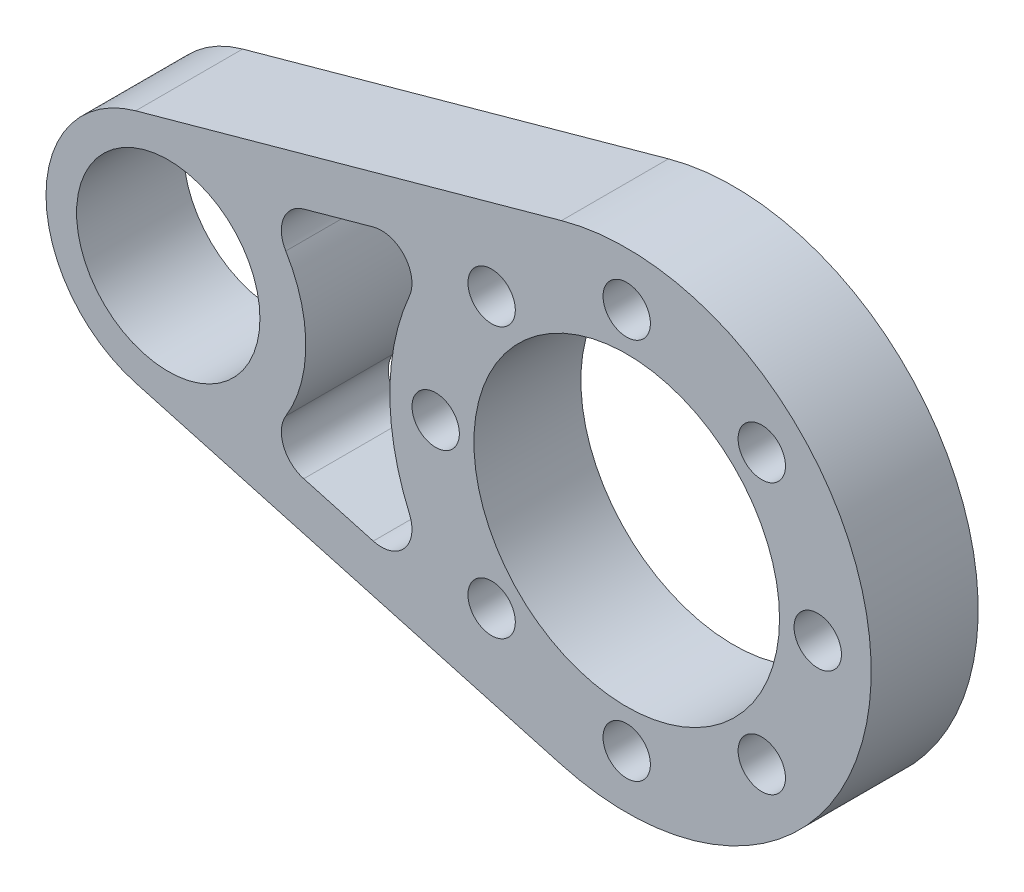
ISO-10303-21;
HEADER;
FILE_DESCRIPTION(('STEP AP214'),'2;1');
FILE_NAME('part.step','',(''),(''),'','','');
FILE_SCHEMA(('AUTOMOTIVE_DESIGN { 1 0 10303 214 1 1 1 1 }'));
ENDSEC;
DATA;
#1=APPLICATION_CONTEXT('core data for automotive mechanical design processes');
#2=APPLICATION_PROTOCOL_DEFINITION('international standard','automotive_design',2000,#1);
#3=PRODUCT_CONTEXT('',#1,'mechanical');
#4=PRODUCT('Part','Part','',(#3));
#5=PRODUCT_RELATED_PRODUCT_CATEGORY('part','',(#4));
#6=PRODUCT_DEFINITION_FORMATION('','',#4);
#7=PRODUCT_DEFINITION_CONTEXT('part definition',#1,'design');
#8=PRODUCT_DEFINITION('design','',#6,#7);
#9=PRODUCT_DEFINITION_SHAPE('','',#8);
#10=(LENGTH_UNIT() NAMED_UNIT(*) SI_UNIT(.MILLI.,.METRE.));
#11=(NAMED_UNIT(*) PLANE_ANGLE_UNIT() SI_UNIT($,.RADIAN.));
#12=(NAMED_UNIT(*) SI_UNIT($,.STERADIAN.) SOLID_ANGLE_UNIT());
#13=UNCERTAINTY_MEASURE_WITH_UNIT(LENGTH_MEASURE(1.E-05),#10,'distance_accuracy_value','');
#14=(GEOMETRIC_REPRESENTATION_CONTEXT(3) GLOBAL_UNCERTAINTY_ASSIGNED_CONTEXT((#13)) GLOBAL_UNIT_ASSIGNED_CONTEXT((#10,
#11,#12)) REPRESENTATION_CONTEXT('',''));
#15=CARTESIAN_POINT('',(0.,0.,0.));
#16=DIRECTION('',(0.,0.,1.));
#17=DIRECTION('',(1.,0.,0.));
#18=AXIS2_PLACEMENT_3D('',#15,#16,#17);
#19=CARTESIAN_POINT('',(30.,0.,7.));
#20=DIRECTION('',(0.,0.,1.));
#21=DIRECTION('',(1.,0.,0.));
#22=AXIS2_PLACEMENT_3D('',#19,#20,#21);
#23=PLANE('',#22);
#24=CARTESIAN_POINT('',(42.5,-1.42247325030098E-13,7.));
#25=DIRECTION('',(0.,0.,1.));
#26=DIRECTION('',(1.,0.,0.));
#27=AXIS2_PLACEMENT_3D('',#24,#25,#26);
#28=CIRCLE('',#27,1.55);
#29=CARTESIAN_POINT('',(44.05,-1.42247325030098E-13,7.));
#30=VERTEX_POINT('',#29);
#31=EDGE_CURVE('E225',#30,#30,#28,.T.);
#32=ORIENTED_EDGE('',*,*,#31,.F.);
#33=EDGE_LOOP('',(#32));
#34=FACE_BOUND('',#33,.T.);
#35=CARTESIAN_POINT('',(30.0000000000003,12.5,7.));
#36=DIRECTION('',(0.,0.,1.));
#37=DIRECTION('',(1.,0.,0.));
#38=AXIS2_PLACEMENT_3D('',#35,#36,#37);
#39=CIRCLE('',#38,1.55);
#40=CARTESIAN_POINT('',(31.5500000000003,12.5,7.));
#41=VERTEX_POINT('',#40);
#42=EDGE_CURVE('E237',#41,#41,#39,.T.);
#43=ORIENTED_EDGE('',*,*,#42,.F.);
#44=EDGE_LOOP('',(#43));
#45=FACE_BOUND('',#44,.T.);
#46=CARTESIAN_POINT('',(17.5,2.25514051876985E-13,7.));
#47=DIRECTION('',(0.,0.,1.));
#48=DIRECTION('',(1.,0.,0.));
#49=AXIS2_PLACEMENT_3D('',#46,#47,#48);
#50=CIRCLE('',#49,1.55);
#51=CARTESIAN_POINT('',(19.05,2.25514051876985E-13,7.));
#52=VERTEX_POINT('',#51);
#53=EDGE_CURVE('E249',#52,#52,#50,.T.);
#54=ORIENTED_EDGE('',*,*,#53,.F.);
#55=EDGE_LOOP('',(#54));
#56=FACE_BOUND('',#55,.T.);
#57=CARTESIAN_POINT('',(30.,-12.5,7.));
#58=DIRECTION('',(0.,0.,1.));
#59=DIRECTION('',(1.,0.,0.));
#60=AXIS2_PLACEMENT_3D('',#57,#58,#59);
#61=CIRCLE('',#60,1.55);
#62=CARTESIAN_POINT('',(31.55,-12.5,7.));
#63=VERTEX_POINT('',#62);
#64=EDGE_CURVE('E261',#63,#63,#61,.T.);
#65=ORIENTED_EDGE('',*,*,#64,.F.);
#66=EDGE_LOOP('',(#65));
#67=FACE_BOUND('',#66,.T.);
#68=CARTESIAN_POINT('',(0.,0.,7.));
#69=DIRECTION('',(0.,0.,1.));
#70=DIRECTION('',(1.,0.,0.));
#71=AXIS2_PLACEMENT_3D('',#68,#69,#70);
#72=CIRCLE('',#71,6.);
#73=CARTESIAN_POINT('',(6.,0.,7.));
#74=VERTEX_POINT('',#73);
#75=EDGE_CURVE('E273',#74,#74,#72,.T.);
#76=ORIENTED_EDGE('',*,*,#75,.F.);
#77=EDGE_LOOP('',(#76));
#78=FACE_BOUND('',#77,.T.);
#79=CARTESIAN_POINT('',(30.,0.,7.));
#80=DIRECTION('',(0.,0.,1.));
#81=DIRECTION('',(1.,0.,0.));
#82=AXIS2_PLACEMENT_3D('',#79,#80,#81);
#83=CIRCLE('',#82,16.);
#84=CARTESIAN_POINT('',(25.7333333333333,-15.4206211144544,7.));
#85=VERTEX_POINT('',#84);
#86=CARTESIAN_POINT('',(25.7333333333333,15.4206211144544,7.));
#87=VERTEX_POINT('',#86);
#88=EDGE_CURVE('E134',#85,#87,#83,.T.);
#89=ORIENTED_EDGE('',*,*,#88,.T.);
#90=DIRECTION('',(-0.963788819653397,-0.266666666666667,0.));
#91=VECTOR('',#90,1.);
#92=CARTESIAN_POINT('',(25.7333333333333,15.4206211144544,7.));
#93=LINE('',#92,#91);
#94=CARTESIAN_POINT('',(-2.13333333333333,7.71031055722718,7.));
#95=VERTEX_POINT('',#94);
#96=EDGE_CURVE('E123',#87,#95,#93,.T.);
#97=ORIENTED_EDGE('',*,*,#96,.T.);
#98=CARTESIAN_POINT('',(0.,0.,7.));
#99=DIRECTION('',(0.,0.,1.));
#100=DIRECTION('',(1.,0.,0.));
#101=AXIS2_PLACEMENT_3D('',#98,#99,#100);
#102=CIRCLE('',#101,8.);
#103=CARTESIAN_POINT('',(-2.13333333333333,-7.71031055722718,7.));
#104=VERTEX_POINT('',#103);
#105=EDGE_CURVE('E133',#95,#104,#102,.T.);
#106=ORIENTED_EDGE('',*,*,#105,.T.);
#107=DIRECTION('',(0.963788819653397,-0.266666666666667,0.));
#108=VECTOR('',#107,1.);
#109=CARTESIAN_POINT('',(25.7333333333333,-15.4206211144544,7.));
#110=LINE('',#109,#108);
#111=EDGE_CURVE('E139',#104,#85,#110,.T.);
#112=ORIENTED_EDGE('',*,*,#111,.T.);
#113=EDGE_LOOP('',(#89,#97,#106,#112));
#114=FACE_BOUND('',#113,.T.);
#115=CARTESIAN_POINT('',(30.,0.,7.));
#116=DIRECTION('',(0.,0.,1.));
#117=DIRECTION('',(1.,0.,0.));
#118=AXIS2_PLACEMENT_3D('',#115,#116,#117);
#119=CIRCLE('',#118,10.);
#120=CARTESIAN_POINT('',(40.,0.,7.));
#121=VERTEX_POINT('',#120);
#122=EDGE_CURVE('E267',#121,#121,#119,.T.);
#123=ORIENTED_EDGE('',*,*,#122,.F.);
#124=EDGE_LOOP('',(#123));
#125=FACE_BOUND('',#124,.T.);
#126=CARTESIAN_POINT('',(21.161165235168,-8.8388347648317,7.));
#127=DIRECTION('',(0.,0.,1.));
#128=DIRECTION('',(1.,0.,0.));
#129=AXIS2_PLACEMENT_3D('',#126,#127,#128);
#130=CIRCLE('',#129,1.55);
#131=CARTESIAN_POINT('',(22.711165235168,-8.8388347648317,7.));
#132=VERTEX_POINT('',#131);
#133=EDGE_CURVE('E255',#132,#132,#130,.T.);
#134=ORIENTED_EDGE('',*,*,#133,.F.);
#135=EDGE_LOOP('',(#134));
#136=FACE_BOUND('',#135,.T.);
#137=CARTESIAN_POINT('',(21.1611652351683,8.83883476483202,7.));
#138=DIRECTION('',(0.,0.,1.));
#139=DIRECTION('',(1.,0.,0.));
#140=AXIS2_PLACEMENT_3D('',#137,#138,#139);
#141=CIRCLE('',#140,1.55);
#142=CARTESIAN_POINT('',(22.7111652351683,8.83883476483202,7.));
#143=VERTEX_POINT('',#142);
#144=EDGE_CURVE('E243',#143,#143,#141,.T.);
#145=ORIENTED_EDGE('',*,*,#144,.F.);
#146=EDGE_LOOP('',(#145));
#147=FACE_BOUND('',#146,.T.);
#148=CARTESIAN_POINT('',(38.8388347648321,8.83883476483164,7.));
#149=DIRECTION('',(0.,0.,1.));
#150=DIRECTION('',(1.,0.,0.));
#151=AXIS2_PLACEMENT_3D('',#148,#149,#150);
#152=CIRCLE('',#151,1.55);
#153=CARTESIAN_POINT('',(40.388834764832,8.83883476483164,7.));
#154=VERTEX_POINT('',#153);
#155=EDGE_CURVE('E231',#154,#154,#152,.T.);
#156=ORIENTED_EDGE('',*,*,#155,.F.);
#157=EDGE_LOOP('',(#156));
#158=FACE_BOUND('',#157,.T.);
#159=CARTESIAN_POINT('',(38.8388347648317,-8.83883476483195,7.));
#160=DIRECTION('',(0.,0.,1.));
#161=DIRECTION('',(1.,0.,0.));
#162=AXIS2_PLACEMENT_3D('',#159,#160,#161);
#163=CIRCLE('',#162,1.55);
#164=CARTESIAN_POINT('',(40.3888347648317,-8.83883476483195,7.));
#165=VERTEX_POINT('',#164);
#166=EDGE_CURVE('E219',#165,#165,#163,.T.);
#167=ORIENTED_EDGE('',*,*,#166,.F.);
#168=EDGE_LOOP('',(#167));
#169=FACE_BOUND('',#168,.T.);
#170=DIRECTION('',(0.963788819653397,-0.266666666666667,0.));
#171=VECTOR('',#170,1.);
#172=CARTESIAN_POINT('',(5.87900177935921,-6.81449470454642,7.));
#173=LINE('',#172,#171);
#174=CARTESIAN_POINT('',(8.86644879941615,-7.64107883006922,7.));
#175=VERTEX_POINT('',#174);
#176=CARTESIAN_POINT('',(13.4155337211016,-8.89974596514318,7.));
#177=VERTEX_POINT('',#176);
#178=EDGE_CURVE('E201',#175,#177,#173,.T.);
#179=ORIENTED_EDGE('',*,*,#178,.F.);
#180=CARTESIAN_POINT('',(9.39978213274948,-5.71350119076242,7.));
#181=DIRECTION('',(0.,0.,1.));
#182=DIRECTION('',(1.,0.,0.));
#183=AXIS2_PLACEMENT_3D('',#180,#181,#182);
#184=CIRCLE('',#183,2.);
#185=CARTESIAN_POINT('',(7.69073083588594,-4.67468279244198,7.));
#186=VERTEX_POINT('',#185);
#187=EDGE_CURVE('E182',#175,#186,#184,.F.);
#188=ORIENTED_EDGE('',*,*,#187,.T.);
#189=CARTESIAN_POINT('',(0.,0.,7.));
#190=DIRECTION('',(0.,0.,-1.));
#191=DIRECTION('',(1.,0.,0.));
#192=AXIS2_PLACEMENT_3D('',#189,#190,#191);
#193=CIRCLE('',#192,9.);
#194=CARTESIAN_POINT('',(7.69073083588594,4.67468279244198,7.));
#195=VERTEX_POINT('',#194);
#196=EDGE_CURVE('E204',#195,#186,#193,.T.);
#197=ORIENTED_EDGE('',*,*,#196,.F.);
#198=CARTESIAN_POINT('',(9.39978213274948,5.71350119076242,7.));
#199=DIRECTION('',(0.,0.,1.));
#200=DIRECTION('',(1.,0.,0.));
#201=AXIS2_PLACEMENT_3D('',#198,#199,#200);
#202=CIRCLE('',#201,2.);
#203=CARTESIAN_POINT('',(8.86644879941615,7.64107883006922,7.));
#204=VERTEX_POINT('',#203);
#205=EDGE_CURVE('E178',#195,#204,#202,.F.);
#206=ORIENTED_EDGE('',*,*,#205,.T.);
#207=DIRECTION('',(-0.963788819653397,-0.266666666666667,0.));
#208=VECTOR('',#207,1.);
#209=CARTESIAN_POINT('',(18.3980193668454,10.2783289200096,7.));
#210=LINE('',#209,#208);
#211=CARTESIAN_POINT('',(13.4155337211016,8.89974596514318,7.));
#212=VERTEX_POINT('',#211);
#213=EDGE_CURVE('E206',#212,#204,#210,.T.);
#214=ORIENTED_EDGE('',*,*,#213,.F.);
#215=CARTESIAN_POINT('',(13.948867054435,6.97216832583638,7.));
#216=DIRECTION('',(0.,0.,1.));
#217=DIRECTION('',(1.,0.,0.));
#218=AXIS2_PLACEMENT_3D('',#215,#216,#217);
#219=CIRCLE('',#218,2.);
#220=CARTESIAN_POINT('',(15.7832822482138,6.17534908859794,7.));
#221=VERTEX_POINT('',#220);
#222=EDGE_CURVE('E174',#212,#221,#219,.F.);
#223=ORIENTED_EDGE('',*,*,#222,.T.);
#224=CARTESIAN_POINT('',(30.,0.,7.));
#225=DIRECTION('',(0.,0.,-1.));
#226=DIRECTION('',(-1.,0.,0.));
#227=AXIS2_PLACEMENT_3D('',#224,#225,#226);
#228=CIRCLE('',#227,15.5);
#229=CARTESIAN_POINT('',(15.7832822482138,-6.17534908859794,7.));
#230=VERTEX_POINT('',#229);
#231=EDGE_CURVE('E203',#230,#221,#228,.T.);
#232=ORIENTED_EDGE('',*,*,#231,.F.);
#233=CARTESIAN_POINT('',(13.948867054435,-6.97216832583639,7.));
#234=DIRECTION('',(0.,0.,1.));
#235=DIRECTION('',(1.,0.,0.));
#236=AXIS2_PLACEMENT_3D('',#233,#234,#235);
#237=CIRCLE('',#236,2.);
#238=EDGE_CURVE('E11',#230,#177,#237,.F.);
#239=ORIENTED_EDGE('',*,*,#238,.T.);
#240=EDGE_LOOP('',(#179,#188,#197,#206,#214,#223,#232,#239));
#241=FACE_BOUND('',#240,.T.);
#242=ADVANCED_FACE('F34',(#34,#45,#56,#67,#78,#114,#125,#136,#147,#158,#169,#241),#23,.T.);
#243=CARTESIAN_POINT('',(30.,0.,0.));
#244=DIRECTION('',(0.,0.,1.));
#245=DIRECTION('',(1.,0.,0.));
#246=AXIS2_PLACEMENT_3D('',#243,#244,#245);
#247=PLANE('',#246);
#248=CARTESIAN_POINT('',(38.8388347648317,-8.83883476483195,0.));
#249=DIRECTION('',(0.,0.,1.));
#250=DIRECTION('',(1.,0.,0.));
#251=AXIS2_PLACEMENT_3D('',#248,#249,#250);
#252=CIRCLE('',#251,1.55);
#253=CARTESIAN_POINT('',(40.3888347648317,-8.83883476483195,0.));
#254=VERTEX_POINT('',#253);
#255=EDGE_CURVE('E213',#254,#254,#252,.T.);
#256=ORIENTED_EDGE('',*,*,#255,.T.);
#257=EDGE_LOOP('',(#256));
#258=FACE_BOUND('',#257,.T.);
#259=CARTESIAN_POINT('',(42.5,-1.42247325030098E-13,0.));
#260=DIRECTION('',(0.,0.,1.));
#261=DIRECTION('',(1.,0.,0.));
#262=AXIS2_PLACEMENT_3D('',#259,#260,#261);
#263=CIRCLE('',#262,1.55);
#264=CARTESIAN_POINT('',(44.05,-1.42247325030098E-13,0.));
#265=VERTEX_POINT('',#264);
#266=EDGE_CURVE('E222',#265,#265,#263,.T.);
#267=ORIENTED_EDGE('',*,*,#266,.T.);
#268=EDGE_LOOP('',(#267));
#269=FACE_BOUND('',#268,.T.);
#270=CARTESIAN_POINT('',(38.8388347648321,8.83883476483164,0.));
#271=DIRECTION('',(0.,0.,1.));
#272=DIRECTION('',(1.,0.,0.));
#273=AXIS2_PLACEMENT_3D('',#270,#271,#272);
#274=CIRCLE('',#273,1.55);
#275=CARTESIAN_POINT('',(40.388834764832,8.83883476483164,0.));
#276=VERTEX_POINT('',#275);
#277=EDGE_CURVE('E228',#276,#276,#274,.T.);
#278=ORIENTED_EDGE('',*,*,#277,.T.);
#279=EDGE_LOOP('',(#278));
#280=FACE_BOUND('',#279,.T.);
#281=CARTESIAN_POINT('',(30.0000000000003,12.5,0.));
#282=DIRECTION('',(0.,0.,1.));
#283=DIRECTION('',(1.,0.,0.));
#284=AXIS2_PLACEMENT_3D('',#281,#282,#283);
#285=CIRCLE('',#284,1.55);
#286=CARTESIAN_POINT('',(31.5500000000003,12.5,0.));
#287=VERTEX_POINT('',#286);
#288=EDGE_CURVE('E234',#287,#287,#285,.T.);
#289=ORIENTED_EDGE('',*,*,#288,.T.);
#290=EDGE_LOOP('',(#289));
#291=FACE_BOUND('',#290,.T.);
#292=CARTESIAN_POINT('',(21.1611652351683,8.83883476483202,0.));
#293=DIRECTION('',(0.,0.,1.));
#294=DIRECTION('',(1.,0.,0.));
#295=AXIS2_PLACEMENT_3D('',#292,#293,#294);
#296=CIRCLE('',#295,1.55);
#297=CARTESIAN_POINT('',(22.7111652351683,8.83883476483202,0.));
#298=VERTEX_POINT('',#297);
#299=EDGE_CURVE('E240',#298,#298,#296,.T.);
#300=ORIENTED_EDGE('',*,*,#299,.T.);
#301=EDGE_LOOP('',(#300));
#302=FACE_BOUND('',#301,.T.);
#303=CARTESIAN_POINT('',(17.5,2.25514051876985E-13,0.));
#304=DIRECTION('',(0.,0.,1.));
#305=DIRECTION('',(1.,0.,0.));
#306=AXIS2_PLACEMENT_3D('',#303,#304,#305);
#307=CIRCLE('',#306,1.55);
#308=CARTESIAN_POINT('',(19.05,2.25514051876985E-13,0.));
#309=VERTEX_POINT('',#308);
#310=EDGE_CURVE('E246',#309,#309,#307,.T.);
#311=ORIENTED_EDGE('',*,*,#310,.T.);
#312=EDGE_LOOP('',(#311));
#313=FACE_BOUND('',#312,.T.);
#314=CARTESIAN_POINT('',(21.161165235168,-8.8388347648317,0.));
#315=DIRECTION('',(0.,0.,1.));
#316=DIRECTION('',(1.,0.,0.));
#317=AXIS2_PLACEMENT_3D('',#314,#315,#316);
#318=CIRCLE('',#317,1.55);
#319=CARTESIAN_POINT('',(22.711165235168,-8.8388347648317,0.));
#320=VERTEX_POINT('',#319);
#321=EDGE_CURVE('E252',#320,#320,#318,.T.);
#322=ORIENTED_EDGE('',*,*,#321,.T.);
#323=EDGE_LOOP('',(#322));
#324=FACE_BOUND('',#323,.T.);
#325=CARTESIAN_POINT('',(30.,-12.5,0.));
#326=DIRECTION('',(0.,0.,1.));
#327=DIRECTION('',(1.,0.,0.));
#328=AXIS2_PLACEMENT_3D('',#325,#326,#327);
#329=CIRCLE('',#328,1.55);
#330=CARTESIAN_POINT('',(31.55,-12.5,0.));
#331=VERTEX_POINT('',#330);
#332=EDGE_CURVE('E258',#331,#331,#329,.T.);
#333=ORIENTED_EDGE('',*,*,#332,.T.);
#334=EDGE_LOOP('',(#333));
#335=FACE_BOUND('',#334,.T.);
#336=CARTESIAN_POINT('',(30.,0.,0.));
#337=DIRECTION('',(0.,0.,1.));
#338=DIRECTION('',(1.,0.,0.));
#339=AXIS2_PLACEMENT_3D('',#336,#337,#338);
#340=CIRCLE('',#339,10.);
#341=CARTESIAN_POINT('',(40.,0.,0.));
#342=VERTEX_POINT('',#341);
#343=EDGE_CURVE('E264',#342,#342,#340,.T.);
#344=ORIENTED_EDGE('',*,*,#343,.T.);
#345=EDGE_LOOP('',(#344));
#346=FACE_BOUND('',#345,.T.);
#347=CARTESIAN_POINT('',(0.,0.,0.));
#348=DIRECTION('',(0.,0.,1.));
#349=DIRECTION('',(1.,0.,0.));
#350=AXIS2_PLACEMENT_3D('',#347,#348,#349);
#351=CIRCLE('',#350,6.);
#352=CARTESIAN_POINT('',(6.,0.,0.));
#353=VERTEX_POINT('',#352);
#354=EDGE_CURVE('E270',#353,#353,#351,.T.);
#355=ORIENTED_EDGE('',*,*,#354,.T.);
#356=EDGE_LOOP('',(#355));
#357=FACE_BOUND('',#356,.T.);
#358=CARTESIAN_POINT('',(30.,0.,0.));
#359=DIRECTION('',(0.,0.,1.));
#360=DIRECTION('',(1.,0.,0.));
#361=AXIS2_PLACEMENT_3D('',#358,#359,#360);
#362=CIRCLE('',#361,16.);
#363=CARTESIAN_POINT('',(25.7333333333333,-15.4206211144544,0.));
#364=VERTEX_POINT('',#363);
#365=CARTESIAN_POINT('',(25.7333333333333,15.4206211144544,0.));
#366=VERTEX_POINT('',#365);
#367=EDGE_CURVE('E147',#364,#366,#362,.T.);
#368=ORIENTED_EDGE('',*,*,#367,.F.);
#369=DIRECTION('',(0.963788819653397,-0.266666666666667,0.));
#370=VECTOR('',#369,1.);
#371=CARTESIAN_POINT('',(25.7333333333333,-15.4206211144544,0.));
#372=LINE('',#371,#370);
#373=CARTESIAN_POINT('',(-2.13333333333333,-7.71031055722718,0.));
#374=VERTEX_POINT('',#373);
#375=EDGE_CURVE('E143',#374,#364,#372,.T.);
#376=ORIENTED_EDGE('',*,*,#375,.F.);
#377=CARTESIAN_POINT('',(0.,0.,0.));
#378=DIRECTION('',(0.,0.,1.));
#379=DIRECTION('',(1.,0.,0.));
#380=AXIS2_PLACEMENT_3D('',#377,#378,#379);
#381=CIRCLE('',#380,8.);
#382=CARTESIAN_POINT('',(-2.13333333333333,7.71031055722718,0.));
#383=VERTEX_POINT('',#382);
#384=EDGE_CURVE('E284',#383,#374,#381,.T.);
#385=ORIENTED_EDGE('',*,*,#384,.F.);
#386=DIRECTION('',(-0.963788819653397,-0.266666666666667,0.));
#387=VECTOR('',#386,1.);
#388=CARTESIAN_POINT('',(25.7333333333333,15.4206211144544,0.));
#389=LINE('',#388,#387);
#390=EDGE_CURVE('E282',#366,#383,#389,.T.);
#391=ORIENTED_EDGE('',*,*,#390,.F.);
#392=EDGE_LOOP('',(#368,#376,#385,#391));
#393=FACE_BOUND('',#392,.T.);
#394=DIRECTION('',(-0.963788819653397,-0.266666666666667,0.));
#395=VECTOR('',#394,1.);
#396=CARTESIAN_POINT('',(18.3980193668454,10.2783289200096,0.));
#397=LINE('',#396,#395);
#398=CARTESIAN_POINT('',(13.4155337211016,8.89974596514318,0.));
#399=VERTEX_POINT('',#398);
#400=CARTESIAN_POINT('',(8.86644879941615,7.64107883006922,0.));
#401=VERTEX_POINT('',#400);
#402=EDGE_CURVE('E198',#399,#401,#397,.T.);
#403=ORIENTED_EDGE('',*,*,#402,.T.);
#404=CARTESIAN_POINT('',(9.39978213274948,5.71350119076242,0.));
#405=DIRECTION('',(0.,0.,1.));
#406=DIRECTION('',(1.,0.,0.));
#407=AXIS2_PLACEMENT_3D('',#404,#405,#406);
#408=CIRCLE('',#407,2.);
#409=CARTESIAN_POINT('',(7.69073083588594,4.67468279244198,0.));
#410=VERTEX_POINT('',#409);
#411=EDGE_CURVE('E176',#401,#410,#408,.T.);
#412=ORIENTED_EDGE('',*,*,#411,.T.);
#413=CARTESIAN_POINT('',(0.,0.,0.));
#414=DIRECTION('',(0.,0.,-1.));
#415=DIRECTION('',(1.,0.,0.));
#416=AXIS2_PLACEMENT_3D('',#413,#414,#415);
#417=CIRCLE('',#416,9.);
#418=CARTESIAN_POINT('',(7.69073083588594,-4.67468279244198,0.));
#419=VERTEX_POINT('',#418);
#420=EDGE_CURVE('E214',#410,#419,#417,.T.);
#421=ORIENTED_EDGE('',*,*,#420,.T.);
#422=CARTESIAN_POINT('',(9.39978213274948,-5.71350119076242,0.));
#423=DIRECTION('',(0.,0.,1.));
#424=DIRECTION('',(1.,0.,0.));
#425=AXIS2_PLACEMENT_3D('',#422,#423,#424);
#426=CIRCLE('',#425,2.);
#427=CARTESIAN_POINT('',(8.86644879941615,-7.64107883006922,0.));
#428=VERTEX_POINT('',#427);
#429=EDGE_CURVE('E180',#419,#428,#426,.T.);
#430=ORIENTED_EDGE('',*,*,#429,.T.);
#431=DIRECTION('',(0.963788819653397,-0.266666666666667,0.));
#432=VECTOR('',#431,1.);
#433=CARTESIAN_POINT('',(5.87900177935921,-6.81449470454642,0.));
#434=LINE('',#433,#432);
#435=CARTESIAN_POINT('',(13.4155337211016,-8.89974596514318,0.));
#436=VERTEX_POINT('',#435);
#437=EDGE_CURVE('E190',#428,#436,#434,.T.);
#438=ORIENTED_EDGE('',*,*,#437,.T.);
#439=CARTESIAN_POINT('',(13.948867054435,-6.97216832583639,0.));
#440=DIRECTION('',(0.,0.,1.));
#441=DIRECTION('',(1.,0.,0.));
#442=AXIS2_PLACEMENT_3D('',#439,#440,#441);
#443=CIRCLE('',#442,2.);
#444=CARTESIAN_POINT('',(15.7832822482138,-6.17534908859794,0.));
#445=VERTEX_POINT('',#444);
#446=EDGE_CURVE('E42',#436,#445,#443,.T.);
#447=ORIENTED_EDGE('',*,*,#446,.T.);
#448=CARTESIAN_POINT('',(30.,0.,0.));
#449=DIRECTION('',(0.,0.,-1.));
#450=DIRECTION('',(-1.,0.,0.));
#451=AXIS2_PLACEMENT_3D('',#448,#449,#450);
#452=CIRCLE('',#451,15.5);
#453=CARTESIAN_POINT('',(15.7832822482138,6.17534908859794,0.));
#454=VERTEX_POINT('',#453);
#455=EDGE_CURVE('E189',#445,#454,#452,.T.);
#456=ORIENTED_EDGE('',*,*,#455,.T.);
#457=CARTESIAN_POINT('',(13.948867054435,6.97216832583638,0.));
#458=DIRECTION('',(0.,0.,1.));
#459=DIRECTION('',(1.,0.,0.));
#460=AXIS2_PLACEMENT_3D('',#457,#458,#459);
#461=CIRCLE('',#460,2.);
#462=EDGE_CURVE('E172',#454,#399,#461,.T.);
#463=ORIENTED_EDGE('',*,*,#462,.T.);
#464=EDGE_LOOP('',(#403,#412,#421,#430,#438,#447,#456,#463));
#465=FACE_BOUND('',#464,.T.);
#466=ADVANCED_FACE('F188',(#258,#269,#280,#291,#302,#313,#324,#335,#346,#357,#393,#465),#247,.F.);
#467=CARTESIAN_POINT('',(30.,0.,7.));
#468=DIRECTION('',(0.,0.,-1.));
#469=DIRECTION('',(-1.,0.,0.));
#470=AXIS2_PLACEMENT_3D('',#467,#468,#469);
#471=CYLINDRICAL_SURFACE('',#470,16.);
#472=ORIENTED_EDGE('',*,*,#367,.T.);
#473=DIRECTION('',(0.,0.,-1.));
#474=VECTOR('',#473,1.);
#475=CARTESIAN_POINT('',(25.7333333333333,15.4206211144544,7.));
#476=LINE('',#475,#474);
#477=EDGE_CURVE('E127',#87,#366,#476,.T.);
#478=ORIENTED_EDGE('',*,*,#477,.F.);
#479=ORIENTED_EDGE('',*,*,#88,.F.);
#480=DIRECTION('',(0.,0.,-1.));
#481=VECTOR('',#480,1.);
#482=CARTESIAN_POINT('',(25.7333333333333,-15.4206211144544,7.));
#483=LINE('',#482,#481);
#484=EDGE_CURVE('E280',#85,#364,#483,.T.);
#485=ORIENTED_EDGE('',*,*,#484,.T.);
#486=EDGE_LOOP('',(#472,#478,#479,#485));
#487=FACE_BOUND('',#486,.T.);
#488=ADVANCED_FACE('F145',(#487),#471,.T.);
#489=CARTESIAN_POINT('',(25.7333333333333,15.4206211144544,7.));
#490=DIRECTION('',(0.266666666666667,-0.963788819653397,0.));
#491=DIRECTION('',(0.963788819653397,0.266666666666667,0.));
#492=AXIS2_PLACEMENT_3D('',#489,#490,#491);
#493=PLANE('',#492);
#494=ORIENTED_EDGE('',*,*,#390,.T.);
#495=DIRECTION('',(0.,0.,-1.));
#496=VECTOR('',#495,1.);
#497=CARTESIAN_POINT('',(-2.13333333333333,7.71031055722718,7.));
#498=LINE('',#497,#496);
#499=EDGE_CURVE('E130',#95,#383,#498,.T.);
#500=ORIENTED_EDGE('',*,*,#499,.F.);
#501=ORIENTED_EDGE('',*,*,#96,.F.);
#502=ORIENTED_EDGE('',*,*,#477,.T.);
#503=EDGE_LOOP('',(#494,#500,#501,#502));
#504=FACE_BOUND('',#503,.T.);
#505=ADVANCED_FACE('F125',(#504),#493,.F.);
#506=CARTESIAN_POINT('',(0.,0.,7.));
#507=DIRECTION('',(0.,0.,-1.));
#508=DIRECTION('',(-1.,0.,0.));
#509=AXIS2_PLACEMENT_3D('',#506,#507,#508);
#510=CYLINDRICAL_SURFACE('',#509,8.);
#511=ORIENTED_EDGE('',*,*,#384,.T.);
#512=DIRECTION('',(0.,0.,-1.));
#513=VECTOR('',#512,1.);
#514=CARTESIAN_POINT('',(-2.13333333333333,-7.71031055722718,7.));
#515=LINE('',#514,#513);
#516=EDGE_CURVE('E152',#104,#374,#515,.T.);
#517=ORIENTED_EDGE('',*,*,#516,.F.);
#518=ORIENTED_EDGE('',*,*,#105,.F.);
#519=ORIENTED_EDGE('',*,*,#499,.T.);
#520=EDGE_LOOP('',(#511,#517,#518,#519));
#521=FACE_BOUND('',#520,.T.);
#522=ADVANCED_FACE('F295',(#521),#510,.T.);
#523=CARTESIAN_POINT('',(25.7333333333333,-15.4206211144544,7.));
#524=DIRECTION('',(0.266666666666667,0.963788819653397,0.));
#525=DIRECTION('',(-0.963788819653397,0.266666666666667,0.));
#526=AXIS2_PLACEMENT_3D('',#523,#524,#525);
#527=PLANE('',#526);
#528=ORIENTED_EDGE('',*,*,#375,.T.);
#529=ORIENTED_EDGE('',*,*,#484,.F.);
#530=ORIENTED_EDGE('',*,*,#111,.F.);
#531=ORIENTED_EDGE('',*,*,#516,.T.);
#532=EDGE_LOOP('',(#528,#529,#530,#531));
#533=FACE_BOUND('',#532,.T.);
#534=ADVANCED_FACE('F291',(#533),#527,.F.);
#535=CARTESIAN_POINT('',(0.,0.,7.));
#536=DIRECTION('',(0.,0.,-1.));
#537=DIRECTION('',(-1.,0.,0.));
#538=AXIS2_PLACEMENT_3D('',#535,#536,#537);
#539=CYLINDRICAL_SURFACE('',#538,6.);
#540=ORIENTED_EDGE('',*,*,#75,.T.);
#541=EDGE_LOOP('',(#540));
#542=FACE_BOUND('',#541,.T.);
#543=ORIENTED_EDGE('',*,*,#354,.F.);
#544=EDGE_LOOP('',(#543));
#545=FACE_BOUND('',#544,.T.);
#546=ADVANCED_FACE('F302',(#542,#545),#539,.F.);
#547=CARTESIAN_POINT('',(30.,0.,7.));
#548=DIRECTION('',(0.,0.,-1.));
#549=DIRECTION('',(-1.,0.,0.));
#550=AXIS2_PLACEMENT_3D('',#547,#548,#549);
#551=CYLINDRICAL_SURFACE('',#550,10.);
#552=ORIENTED_EDGE('',*,*,#122,.T.);
#553=EDGE_LOOP('',(#552));
#554=FACE_BOUND('',#553,.T.);
#555=ORIENTED_EDGE('',*,*,#343,.F.);
#556=EDGE_LOOP('',(#555));
#557=FACE_BOUND('',#556,.T.);
#558=ADVANCED_FACE('F318',(#554,#557),#551,.F.);
#559=CARTESIAN_POINT('',(30.,-12.5,7.));
#560=DIRECTION('',(0.,0.,-1.));
#561=DIRECTION('',(-1.,0.,0.));
#562=AXIS2_PLACEMENT_3D('',#559,#560,#561);
#563=CYLINDRICAL_SURFACE('',#562,1.55);
#564=ORIENTED_EDGE('',*,*,#64,.T.);
#565=EDGE_LOOP('',(#564));
#566=FACE_BOUND('',#565,.T.);
#567=ORIENTED_EDGE('',*,*,#332,.F.);
#568=EDGE_LOOP('',(#567));
#569=FACE_BOUND('',#568,.T.);
#570=ADVANCED_FACE('F322',(#566,#569),#563,.F.);
#571=CARTESIAN_POINT('',(21.161165235168,-8.8388347648317,7.));
#572=DIRECTION('',(0.,0.,-1.));
#573=DIRECTION('',(-1.,0.,0.));
#574=AXIS2_PLACEMENT_3D('',#571,#572,#573);
#575=CYLINDRICAL_SURFACE('',#574,1.55);
#576=ORIENTED_EDGE('',*,*,#133,.T.);
#577=EDGE_LOOP('',(#576));
#578=FACE_BOUND('',#577,.T.);
#579=ORIENTED_EDGE('',*,*,#321,.F.);
#580=EDGE_LOOP('',(#579));
#581=FACE_BOUND('',#580,.T.);
#582=ADVANCED_FACE('F326',(#578,#581),#575,.F.);
#583=CARTESIAN_POINT('',(17.5,2.25514051876985E-13,7.));
#584=DIRECTION('',(0.,0.,-1.));
#585=DIRECTION('',(-1.,0.,0.));
#586=AXIS2_PLACEMENT_3D('',#583,#584,#585);
#587=CYLINDRICAL_SURFACE('',#586,1.55);
#588=ORIENTED_EDGE('',*,*,#53,.T.);
#589=EDGE_LOOP('',(#588));
#590=FACE_BOUND('',#589,.T.);
#591=ORIENTED_EDGE('',*,*,#310,.F.);
#592=EDGE_LOOP('',(#591));
#593=FACE_BOUND('',#592,.T.);
#594=ADVANCED_FACE('F330',(#590,#593),#587,.F.);
#595=CARTESIAN_POINT('',(21.1611652351683,8.83883476483202,7.));
#596=DIRECTION('',(0.,0.,-1.));
#597=DIRECTION('',(-1.,0.,0.));
#598=AXIS2_PLACEMENT_3D('',#595,#596,#597);
#599=CYLINDRICAL_SURFACE('',#598,1.55);
#600=ORIENTED_EDGE('',*,*,#144,.T.);
#601=EDGE_LOOP('',(#600));
#602=FACE_BOUND('',#601,.T.);
#603=ORIENTED_EDGE('',*,*,#299,.F.);
#604=EDGE_LOOP('',(#603));
#605=FACE_BOUND('',#604,.T.);
#606=ADVANCED_FACE('F334',(#602,#605),#599,.F.);
#607=CARTESIAN_POINT('',(30.0000000000003,12.5,7.));
#608=DIRECTION('',(0.,0.,-1.));
#609=DIRECTION('',(-1.,0.,0.));
#610=AXIS2_PLACEMENT_3D('',#607,#608,#609);
#611=CYLINDRICAL_SURFACE('',#610,1.55);
#612=ORIENTED_EDGE('',*,*,#42,.T.);
#613=EDGE_LOOP('',(#612));
#614=FACE_BOUND('',#613,.T.);
#615=ORIENTED_EDGE('',*,*,#288,.F.);
#616=EDGE_LOOP('',(#615));
#617=FACE_BOUND('',#616,.T.);
#618=ADVANCED_FACE('F338',(#614,#617),#611,.F.);
#619=CARTESIAN_POINT('',(38.8388347648321,8.83883476483164,7.));
#620=DIRECTION('',(0.,0.,-1.));
#621=DIRECTION('',(-1.,0.,0.));
#622=AXIS2_PLACEMENT_3D('',#619,#620,#621);
#623=CYLINDRICAL_SURFACE('',#622,1.55);
#624=ORIENTED_EDGE('',*,*,#155,.T.);
#625=EDGE_LOOP('',(#624));
#626=FACE_BOUND('',#625,.T.);
#627=ORIENTED_EDGE('',*,*,#277,.F.);
#628=EDGE_LOOP('',(#627));
#629=FACE_BOUND('',#628,.T.);
#630=ADVANCED_FACE('F342',(#626,#629),#623,.F.);
#631=CARTESIAN_POINT('',(42.5,-1.42247325030098E-13,7.));
#632=DIRECTION('',(0.,0.,-1.));
#633=DIRECTION('',(-1.,0.,0.));
#634=AXIS2_PLACEMENT_3D('',#631,#632,#633);
#635=CYLINDRICAL_SURFACE('',#634,1.55);
#636=ORIENTED_EDGE('',*,*,#31,.T.);
#637=EDGE_LOOP('',(#636));
#638=FACE_BOUND('',#637,.T.);
#639=ORIENTED_EDGE('',*,*,#266,.F.);
#640=EDGE_LOOP('',(#639));
#641=FACE_BOUND('',#640,.T.);
#642=ADVANCED_FACE('F346',(#638,#641),#635,.F.);
#643=CARTESIAN_POINT('',(38.8388347648317,-8.83883476483195,7.));
#644=DIRECTION('',(0.,0.,-1.));
#645=DIRECTION('',(-1.,0.,0.));
#646=AXIS2_PLACEMENT_3D('',#643,#644,#645);
#647=CYLINDRICAL_SURFACE('',#646,1.55);
#648=ORIENTED_EDGE('',*,*,#166,.T.);
#649=EDGE_LOOP('',(#648));
#650=FACE_BOUND('',#649,.T.);
#651=ORIENTED_EDGE('',*,*,#255,.F.);
#652=EDGE_LOOP('',(#651));
#653=FACE_BOUND('',#652,.T.);
#654=ADVANCED_FACE('F350',(#650,#653),#647,.F.);
#655=CARTESIAN_POINT('',(0.,0.,7.));
#656=DIRECTION('',(0.,0.,-1.));
#657=DIRECTION('',(-1.,0.,0.));
#658=AXIS2_PLACEMENT_3D('',#655,#656,#657);
#659=CYLINDRICAL_SURFACE('',#658,9.);
#660=ORIENTED_EDGE('',*,*,#420,.F.);
#661=DIRECTION('',(0.,0.,-1.));
#662=VECTOR('',#661,1.);
#663=CARTESIAN_POINT('',(7.69073083588594,4.67468279244198,7.));
#664=LINE('',#663,#662);
#665=EDGE_CURVE('E166',#410,#195,#664,.F.);
#666=ORIENTED_EDGE('',*,*,#665,.T.);
#667=ORIENTED_EDGE('',*,*,#196,.T.);
#668=DIRECTION('',(0.,0.,-1.));
#669=VECTOR('',#668,1.);
#670=CARTESIAN_POINT('',(7.69073083588594,-4.67468279244198,7.));
#671=LINE('',#670,#669);
#672=EDGE_CURVE('E163',#186,#419,#671,.T.);
#673=ORIENTED_EDGE('',*,*,#672,.T.);
#674=EDGE_LOOP('',(#660,#666,#667,#673));
#675=FACE_BOUND('',#674,.T.);
#676=ADVANCED_FACE('F354',(#675),#659,.T.);
#677=CARTESIAN_POINT('',(5.87900177935921,-6.81449470454642,7.));
#678=DIRECTION('',(0.266666666666667,0.963788819653397,0.));
#679=DIRECTION('',(-0.963788819653397,0.266666666666667,0.));
#680=AXIS2_PLACEMENT_3D('',#677,#678,#679);
#681=PLANE('',#680);
#682=ORIENTED_EDGE('',*,*,#437,.F.);
#683=DIRECTION('',(0.,0.,1.));
#684=VECTOR('',#683,1.);
#685=CARTESIAN_POINT('',(8.86644879941615,-7.64107883006922,7.));
#686=LINE('',#685,#684);
#687=EDGE_CURVE('E54',#428,#175,#686,.T.);
#688=ORIENTED_EDGE('',*,*,#687,.T.);
#689=ORIENTED_EDGE('',*,*,#178,.T.);
#690=DIRECTION('',(0.,0.,1.));
#691=VECTOR('',#690,1.);
#692=CARTESIAN_POINT('',(13.4155337211016,-8.89974596514318,0.));
#693=LINE('',#692,#691);
#694=EDGE_CURVE('E168',#177,#436,#693,.F.);
#695=ORIENTED_EDGE('',*,*,#694,.T.);
#696=EDGE_LOOP('',(#682,#688,#689,#695));
#697=FACE_BOUND('',#696,.T.);
#698=ADVANCED_FACE('F200',(#697),#681,.T.);
#699=CARTESIAN_POINT('',(30.,0.,7.));
#700=DIRECTION('',(0.,0.,-1.));
#701=DIRECTION('',(-1.,0.,0.));
#702=AXIS2_PLACEMENT_3D('',#699,#700,#701);
#703=CYLINDRICAL_SURFACE('',#702,15.5);
#704=ORIENTED_EDGE('',*,*,#231,.T.);
#705=DIRECTION('',(0.,0.,-1.));
#706=VECTOR('',#705,1.);
#707=CARTESIAN_POINT('',(15.7832822482138,6.17534908859794,7.));
#708=LINE('',#707,#706);
#709=EDGE_CURVE('E150',#221,#454,#708,.T.);
#710=ORIENTED_EDGE('',*,*,#709,.T.);
#711=ORIENTED_EDGE('',*,*,#455,.F.);
#712=DIRECTION('',(0.,0.,-1.));
#713=VECTOR('',#712,1.);
#714=CARTESIAN_POINT('',(15.7832822482138,-6.17534908859794,7.));
#715=LINE('',#714,#713);
#716=EDGE_CURVE('E148',#445,#230,#715,.F.);
#717=ORIENTED_EDGE('',*,*,#716,.T.);
#718=EDGE_LOOP('',(#704,#710,#711,#717));
#719=FACE_BOUND('',#718,.T.);
#720=ADVANCED_FACE('F196',(#719),#703,.T.);
#721=CARTESIAN_POINT('',(18.3980193668454,10.2783289200096,7.));
#722=DIRECTION('',(0.266666666666667,-0.963788819653397,0.));
#723=DIRECTION('',(0.963788819653397,0.266666666666667,0.));
#724=AXIS2_PLACEMENT_3D('',#721,#722,#723);
#725=PLANE('',#724);
#726=ORIENTED_EDGE('',*,*,#402,.F.);
#727=DIRECTION('',(0.,0.,1.));
#728=VECTOR('',#727,1.);
#729=CARTESIAN_POINT('',(13.4155337211016,8.89974596514318,7.));
#730=LINE('',#729,#728);
#731=EDGE_CURVE('E161',#399,#212,#730,.T.);
#732=ORIENTED_EDGE('',*,*,#731,.T.);
#733=ORIENTED_EDGE('',*,*,#213,.T.);
#734=DIRECTION('',(0.,0.,1.));
#735=VECTOR('',#734,1.);
#736=CARTESIAN_POINT('',(8.86644879941615,7.64107883006922,0.));
#737=LINE('',#736,#735);
#738=EDGE_CURVE('E158',#204,#401,#737,.F.);
#739=ORIENTED_EDGE('',*,*,#738,.T.);
#740=EDGE_LOOP('',(#726,#732,#733,#739));
#741=FACE_BOUND('',#740,.T.);
#742=ADVANCED_FACE('F363',(#741),#725,.T.);
#743=CARTESIAN_POINT('',(13.948867054435,6.97216832583638,7.));
#744=DIRECTION('',(0.,0.,-1.));
#745=DIRECTION('',(-1.,0.,0.));
#746=AXIS2_PLACEMENT_3D('',#743,#744,#745);
#747=CYLINDRICAL_SURFACE('',#746,2.);
#748=ORIENTED_EDGE('',*,*,#222,.F.);
#749=ORIENTED_EDGE('',*,*,#731,.F.);
#750=ORIENTED_EDGE('',*,*,#462,.F.);
#751=ORIENTED_EDGE('',*,*,#709,.F.);
#752=EDGE_LOOP('',(#748,#749,#750,#751));
#753=FACE_BOUND('',#752,.T.);
#754=ADVANCED_FACE('F365',(#753),#747,.F.);
#755=CARTESIAN_POINT('',(9.39978213274948,5.71350119076242,7.));
#756=DIRECTION('',(0.,0.,-1.));
#757=DIRECTION('',(-1.,0.,0.));
#758=AXIS2_PLACEMENT_3D('',#755,#756,#757);
#759=CYLINDRICAL_SURFACE('',#758,2.);
#760=ORIENTED_EDGE('',*,*,#205,.F.);
#761=ORIENTED_EDGE('',*,*,#665,.F.);
#762=ORIENTED_EDGE('',*,*,#411,.F.);
#763=ORIENTED_EDGE('',*,*,#738,.F.);
#764=EDGE_LOOP('',(#760,#761,#762,#763));
#765=FACE_BOUND('',#764,.T.);
#766=ADVANCED_FACE('F370',(#765),#759,.F.);
#767=CARTESIAN_POINT('',(9.39978213274948,-5.71350119076242,7.));
#768=DIRECTION('',(0.,0.,-1.));
#769=DIRECTION('',(-1.,0.,0.));
#770=AXIS2_PLACEMENT_3D('',#767,#768,#769);
#771=CYLINDRICAL_SURFACE('',#770,2.);
#772=ORIENTED_EDGE('',*,*,#187,.F.);
#773=ORIENTED_EDGE('',*,*,#687,.F.);
#774=ORIENTED_EDGE('',*,*,#429,.F.);
#775=ORIENTED_EDGE('',*,*,#672,.F.);
#776=EDGE_LOOP('',(#772,#773,#774,#775));
#777=FACE_BOUND('',#776,.T.);
#778=ADVANCED_FACE('F385',(#777),#771,.F.);
#779=CARTESIAN_POINT('',(13.948867054435,-6.97216832583639,7.));
#780=DIRECTION('',(0.,0.,-1.));
#781=DIRECTION('',(-1.,0.,0.));
#782=AXIS2_PLACEMENT_3D('',#779,#780,#781);
#783=CYLINDRICAL_SURFACE('',#782,2.);
#784=ORIENTED_EDGE('',*,*,#238,.F.);
#785=ORIENTED_EDGE('',*,*,#716,.F.);
#786=ORIENTED_EDGE('',*,*,#446,.F.);
#787=ORIENTED_EDGE('',*,*,#694,.F.);
#788=EDGE_LOOP('',(#784,#785,#786,#787));
#789=FACE_BOUND('',#788,.T.);
#790=ADVANCED_FACE('F36',(#789),#783,.F.);
#791=CLOSED_SHELL('',(#242,#466,#488,#505,#522,#534,#546,#558,#570,#582,#594,#606,#618,#630,
#642,#654,#676,#698,#720,#742,#754,#766,#778,#790));
#792=MANIFOLD_SOLID_BREP('B2',#791);
#793=ADVANCED_BREP_SHAPE_REPRESENTATION('',(#18,#792),#14);
#794=SHAPE_DEFINITION_REPRESENTATION(#9,#793);
ENDSEC;
END-ISO-10303-21;
